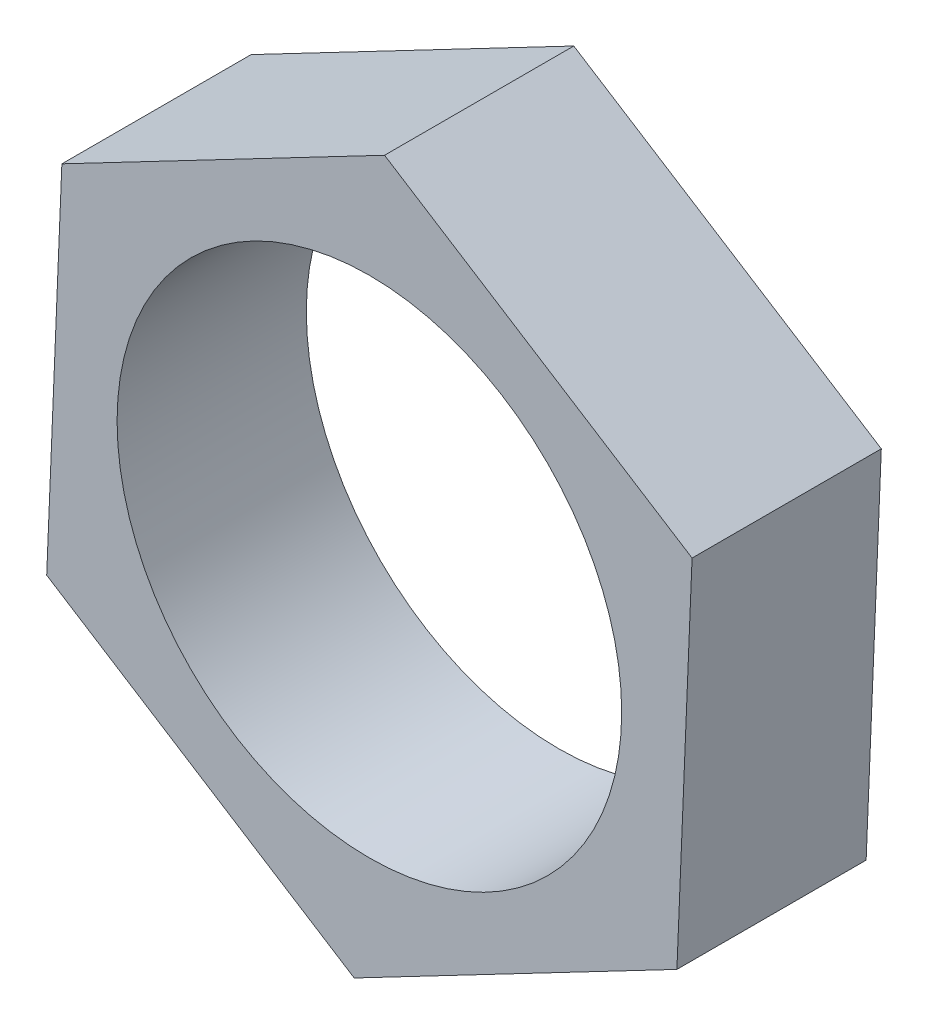
ISO-10303-21;
HEADER;
FILE_DESCRIPTION(('STEP AP214'),'2;1');
FILE_NAME('part.step','',(''),(''),'','','');
FILE_SCHEMA(('AUTOMOTIVE_DESIGN { 1 0 10303 214 1 1 1 1 }'));
ENDSEC;
DATA;
#1=APPLICATION_CONTEXT('core data for automotive mechanical design processes');
#2=APPLICATION_PROTOCOL_DEFINITION('international standard','automotive_design',2000,#1);
#3=PRODUCT_CONTEXT('',#1,'mechanical');
#4=PRODUCT('Part','Part','',(#3));
#5=PRODUCT_RELATED_PRODUCT_CATEGORY('part','',(#4));
#6=PRODUCT_DEFINITION_FORMATION('','',#4);
#7=PRODUCT_DEFINITION_CONTEXT('part definition',#1,'design');
#8=PRODUCT_DEFINITION('design','',#6,#7);
#9=PRODUCT_DEFINITION_SHAPE('','',#8);
#10=(LENGTH_UNIT() NAMED_UNIT(*) SI_UNIT(.MILLI.,.METRE.));
#11=(NAMED_UNIT(*) PLANE_ANGLE_UNIT() SI_UNIT($,.RADIAN.));
#12=(NAMED_UNIT(*) SI_UNIT($,.STERADIAN.) SOLID_ANGLE_UNIT());
#13=UNCERTAINTY_MEASURE_WITH_UNIT(LENGTH_MEASURE(1.E-05),#10,'distance_accuracy_value','');
#14=(GEOMETRIC_REPRESENTATION_CONTEXT(3) GLOBAL_UNCERTAINTY_ASSIGNED_CONTEXT((#13)) GLOBAL_UNIT_ASSIGNED_CONTEXT((#10,
#11,#12)) REPRESENTATION_CONTEXT('',''));
#15=CARTESIAN_POINT('',(0.,0.,0.));
#16=DIRECTION('',(0.,0.,1.));
#17=DIRECTION('',(1.,0.,0.));
#18=AXIS2_PLACEMENT_3D('',#15,#16,#17);
#19=CARTESIAN_POINT('',(-0.240572618673107,-5.76848837638422,-3.));
#20=DIRECTION('',(-0.463479854737405,0.886107456380203,0.));
#21=DIRECTION('',(-0.886107456380203,-0.463479854737405,0.));
#22=AXIS2_PLACEMENT_3D('',#19,#20,#21);
#23=PLANE('',#22);
#24=DIRECTION('',(0.886107456380203,0.463479854737405,0.));
#25=VECTOR('',#24,1.);
#26=CARTESIAN_POINT('',(-0.240572618673107,-5.76848837638422,0.));
#27=LINE('',#26,#25);
#28=CARTESIAN_POINT('',(-0.240572618673107,-5.76848837638422,0.));
#29=VERTEX_POINT('',#28);
#30=CARTESIAN_POINT('',(4.87537116604725,-3.09258618741809,0.));
#31=VERTEX_POINT('',#30);
#32=EDGE_CURVE('E118',#29,#31,#27,.T.);
#33=ORIENTED_EDGE('',*,*,#32,.F.);
#34=DIRECTION('',(0.,0.,0.999999999999999));
#35=VECTOR('',#34,1.);
#36=CARTESIAN_POINT('',(-0.240572618673107,-5.76848837638422,-3.));
#37=LINE('',#36,#35);
#38=CARTESIAN_POINT('',(-0.240572618673107,-5.76848837638422,-3.));
#39=VERTEX_POINT('',#38);
#40=EDGE_CURVE('E117',#39,#29,#37,.T.);
#41=ORIENTED_EDGE('',*,*,#40,.F.);
#42=DIRECTION('',(0.886107456380203,0.463479854737405,0.));
#43=VECTOR('',#42,1.);
#44=CARTESIAN_POINT('',(-0.240572618673107,-5.76848837638422,-3.));
#45=LINE('',#44,#43);
#46=CARTESIAN_POINT('',(4.87537116604725,-3.09258618741809,-3.));
#47=VERTEX_POINT('',#46);
#48=EDGE_CURVE('E131',#39,#47,#45,.T.);
#49=ORIENTED_EDGE('',*,*,#48,.T.);
#50=DIRECTION('',(0.,0.,0.999999999999999));
#51=VECTOR('',#50,1.);
#52=CARTESIAN_POINT('',(4.87537116604725,-3.09258618741809,-3.));
#53=LINE('',#52,#51);
#54=EDGE_CURVE('E11',#47,#31,#53,.T.);
#55=ORIENTED_EDGE('',*,*,#54,.T.);
#56=EDGE_LOOP('',(#33,#41,#49,#55));
#57=FACE_BOUND('',#56,.T.);
#58=ADVANCED_FACE('F35',(#57),#23,.F.);
#59=CARTESIAN_POINT('',(4.87537116604725,-3.09258618741809,-3.));
#60=DIRECTION('',(-0.99913149507677,0.0416683998451878,0.));
#61=DIRECTION('',(-0.0416683998451878,-0.99913149507677,0.));
#62=AXIS2_PLACEMENT_3D('',#59,#60,#61);
#63=PLANE('',#62);
#64=DIRECTION('',(0.0416683998451878,0.99913149507677,0.));
#65=VECTOR('',#64,1.);
#66=CARTESIAN_POINT('',(4.87537116604725,-3.09258618741809,0.));
#67=LINE('',#66,#65);
#68=CARTESIAN_POINT('',(5.11594378472052,2.67590218896602,0.));
#69=VERTEX_POINT('',#68);
#70=EDGE_CURVE('E120',#31,#69,#67,.T.);
#71=ORIENTED_EDGE('',*,*,#70,.F.);
#72=ORIENTED_EDGE('',*,*,#54,.F.);
#73=DIRECTION('',(0.0416683998451878,0.99913149507677,0.));
#74=VECTOR('',#73,1.);
#75=CARTESIAN_POINT('',(4.87537116604725,-3.09258618741809,-3.));
#76=LINE('',#75,#74);
#77=CARTESIAN_POINT('',(5.11594378472052,2.67590218896602,-3.));
#78=VERTEX_POINT('',#77);
#79=EDGE_CURVE('E83',#47,#78,#76,.T.);
#80=ORIENTED_EDGE('',*,*,#79,.T.);
#81=DIRECTION('',(0.,0.,0.999999999999999));
#82=VECTOR('',#81,1.);
#83=CARTESIAN_POINT('',(5.11594378472052,2.67590218896602,-3.));
#84=LINE('',#83,#82);
#85=EDGE_CURVE('E43',#78,#69,#84,.T.);
#86=ORIENTED_EDGE('',*,*,#85,.T.);
#87=EDGE_LOOP('',(#71,#72,#80,#86));
#88=FACE_BOUND('',#87,.T.);
#89=ADVANCED_FACE('F137',(#88),#63,.F.);
#90=CARTESIAN_POINT('',(5.11594378472052,2.67590218896602,-3.));
#91=DIRECTION('',(-0.535651640339365,-0.844439056535016,0.));
#92=DIRECTION('',(0.844439056535016,-0.535651640339365,0.));
#93=AXIS2_PLACEMENT_3D('',#90,#91,#92);
#94=PLANE('',#93);
#95=DIRECTION('',(-0.844439056535016,0.535651640339365,0.));
#96=VECTOR('',#95,1.);
#97=CARTESIAN_POINT('',(5.11594378472052,2.67590218896602,0.));
#98=LINE('',#97,#96);
#99=CARTESIAN_POINT('',(0.240572618673274,5.768488376384,0.));
#100=VERTEX_POINT('',#99);
#101=EDGE_CURVE('E124',#69,#100,#98,.T.);
#102=ORIENTED_EDGE('',*,*,#101,.F.);
#103=ORIENTED_EDGE('',*,*,#85,.F.);
#104=DIRECTION('',(-0.844439056535016,0.535651640339365,0.));
#105=VECTOR('',#104,1.);
#106=CARTESIAN_POINT('',(5.11594378472052,2.67590218896602,-3.));
#107=LINE('',#106,#105);
#108=CARTESIAN_POINT('',(0.240572618673274,5.768488376384,-3.));
#109=VERTEX_POINT('',#108);
#110=EDGE_CURVE('E111',#78,#109,#107,.T.);
#111=ORIENTED_EDGE('',*,*,#110,.T.);
#112=DIRECTION('',(0.,0.,0.999999999999999));
#113=VECTOR('',#112,1.);
#114=CARTESIAN_POINT('',(0.240572618673274,5.768488376384,-3.));
#115=LINE('',#114,#113);
#116=EDGE_CURVE('E105',#109,#100,#115,.T.);
#117=ORIENTED_EDGE('',*,*,#116,.T.);
#118=EDGE_LOOP('',(#102,#103,#111,#117));
#119=FACE_BOUND('',#118,.T.);
#120=ADVANCED_FACE('F170',(#119),#94,.F.);
#121=CARTESIAN_POINT('',(0.240572618673274,5.768488376384,-3.));
#122=DIRECTION('',(0.463479854737405,-0.886107456380203,0.));
#123=DIRECTION('',(0.886107456380203,0.463479854737405,0.));
#124=AXIS2_PLACEMENT_3D('',#121,#122,#123);
#125=PLANE('',#124);
#126=DIRECTION('',(-0.886107456380203,-0.463479854737405,0.));
#127=VECTOR('',#126,1.);
#128=CARTESIAN_POINT('',(0.240572618673274,5.768488376384,0.));
#129=LINE('',#128,#127);
#130=CARTESIAN_POINT('',(-4.87537116604723,3.09258618741798,0.));
#131=VERTEX_POINT('',#130);
#132=EDGE_CURVE('E127',#100,#131,#129,.T.);
#133=ORIENTED_EDGE('',*,*,#132,.F.);
#134=ORIENTED_EDGE('',*,*,#116,.F.);
#135=DIRECTION('',(-0.886107456380203,-0.463479854737405,0.));
#136=VECTOR('',#135,1.);
#137=CARTESIAN_POINT('',(0.240572618673274,5.768488376384,-3.));
#138=LINE('',#137,#136);
#139=CARTESIAN_POINT('',(-4.87537116604723,3.09258618741798,-3.));
#140=VERTEX_POINT('',#139);
#141=EDGE_CURVE('E95',#109,#140,#138,.T.);
#142=ORIENTED_EDGE('',*,*,#141,.T.);
#143=DIRECTION('',(0.,0.,0.999999999999999));
#144=VECTOR('',#143,1.);
#145=CARTESIAN_POINT('',(-4.87537116604723,3.09258618741798,-3.));
#146=LINE('',#145,#144);
#147=EDGE_CURVE('E100',#140,#131,#146,.T.);
#148=ORIENTED_EDGE('',*,*,#147,.T.);
#149=EDGE_LOOP('',(#133,#134,#142,#148));
#150=FACE_BOUND('',#149,.T.);
#151=ADVANCED_FACE('F108',(#150),#125,.F.);
#152=CARTESIAN_POINT('',(-4.87537116604723,3.09258618741798,-3.));
#153=DIRECTION('',(0.99913149507677,-0.0416683998451877,0.));
#154=DIRECTION('',(0.0416683998451877,0.99913149507677,0.));
#155=AXIS2_PLACEMENT_3D('',#152,#153,#154);
#156=PLANE('',#155);
#157=DIRECTION('',(-0.0416683998451878,-0.99913149507677,0.));
#158=VECTOR('',#157,1.);
#159=CARTESIAN_POINT('',(-4.87537116604723,3.09258618741798,0.));
#160=LINE('',#159,#158);
#161=CARTESIAN_POINT('',(-5.11594378472041,-2.67590218896618,0.));
#162=VERTEX_POINT('',#161);
#163=EDGE_CURVE('E102',#131,#162,#160,.T.);
#164=ORIENTED_EDGE('',*,*,#163,.F.);
#165=ORIENTED_EDGE('',*,*,#147,.F.);
#166=DIRECTION('',(-0.0416683998451878,-0.99913149507677,0.));
#167=VECTOR('',#166,1.);
#168=CARTESIAN_POINT('',(-4.87537116604723,3.09258618741798,-3.));
#169=LINE('',#168,#167);
#170=CARTESIAN_POINT('',(-5.11594378472041,-2.67590218896618,-3.));
#171=VERTEX_POINT('',#170);
#172=EDGE_CURVE('E91',#140,#171,#169,.T.);
#173=ORIENTED_EDGE('',*,*,#172,.T.);
#174=DIRECTION('',(0.,0.,0.999999999999999));
#175=VECTOR('',#174,1.);
#176=CARTESIAN_POINT('',(-5.11594378472041,-2.67590218896618,-3.));
#177=LINE('',#176,#175);
#178=EDGE_CURVE('E106',#171,#162,#177,.T.);
#179=ORIENTED_EDGE('',*,*,#178,.T.);
#180=EDGE_LOOP('',(#164,#165,#173,#179));
#181=FACE_BOUND('',#180,.T.);
#182=ADVANCED_FACE('F101',(#181),#156,.F.);
#183=CARTESIAN_POINT('',(-5.11594378472041,-2.67590218896618,-3.));
#184=DIRECTION('',(0.535651640339365,0.844439056535015,0.));
#185=DIRECTION('',(-0.844439056535016,0.535651640339365,0.));
#186=AXIS2_PLACEMENT_3D('',#183,#184,#185);
#187=PLANE('',#186);
#188=DIRECTION('',(0.844439056535015,-0.535651640339365,0.));
#189=VECTOR('',#188,1.);
#190=CARTESIAN_POINT('',(-5.11594378472041,-2.67590218896618,0.));
#191=LINE('',#190,#189);
#192=EDGE_CURVE('E71',#162,#29,#191,.T.);
#193=ORIENTED_EDGE('',*,*,#192,.F.);
#194=ORIENTED_EDGE('',*,*,#178,.F.);
#195=DIRECTION('',(0.844439056535015,-0.535651640339365,0.));
#196=VECTOR('',#195,1.);
#197=CARTESIAN_POINT('',(-5.11594378472041,-2.67590218896618,-3.));
#198=LINE('',#197,#196);
#199=EDGE_CURVE('E51',#171,#39,#198,.T.);
#200=ORIENTED_EDGE('',*,*,#199,.T.);
#201=ORIENTED_EDGE('',*,*,#40,.T.);
#202=EDGE_LOOP('',(#193,#194,#200,#201));
#203=FACE_BOUND('',#202,.T.);
#204=ADVANCED_FACE('F162',(#203),#187,.F.);
#205=CARTESIAN_POINT('',(0.,0.,-3.));
#206=DIRECTION('',(0.,0.,-0.999999999999999));
#207=DIRECTION('',(1.,0.,0.));
#208=AXIS2_PLACEMENT_3D('',#205,#206,#207);
#209=PLANE('',#208);
#210=CARTESIAN_POINT('',(0.,0.,-3.));
#211=DIRECTION('',(0.,0.,0.999999999999999));
#212=DIRECTION('',(1.,0.,0.));
#213=AXIS2_PLACEMENT_3D('',#210,#211,#212);
#214=CIRCLE('',#213,4.);
#215=CARTESIAN_POINT('',(4.,0.,-3.));
#216=VERTEX_POINT('',#215);
#217=EDGE_CURVE('E146',#216,#216,#214,.T.);
#218=ORIENTED_EDGE('',*,*,#217,.T.);
#219=EDGE_LOOP('',(#218));
#220=FACE_BOUND('',#219,.T.);
#221=ORIENTED_EDGE('',*,*,#48,.F.);
#222=ORIENTED_EDGE('',*,*,#199,.F.);
#223=ORIENTED_EDGE('',*,*,#172,.F.);
#224=ORIENTED_EDGE('',*,*,#141,.F.);
#225=ORIENTED_EDGE('',*,*,#110,.F.);
#226=ORIENTED_EDGE('',*,*,#79,.F.);
#227=EDGE_LOOP('',(#221,#222,#223,#224,#225,#226));
#228=FACE_BOUND('',#227,.T.);
#229=ADVANCED_FACE('F93',(#220,#228),#209,.T.);
#230=CARTESIAN_POINT('',(0.,0.,0.));
#231=DIRECTION('',(0.,0.,-0.999999999999999));
#232=DIRECTION('',(1.,0.,0.));
#233=AXIS2_PLACEMENT_3D('',#230,#231,#232);
#234=PLANE('',#233);
#235=CARTESIAN_POINT('',(0.,0.,0.));
#236=DIRECTION('',(0.,0.,0.999999999999999));
#237=DIRECTION('',(1.,0.,0.));
#238=AXIS2_PLACEMENT_3D('',#235,#236,#237);
#239=CIRCLE('',#238,4.);
#240=CARTESIAN_POINT('',(4.,0.,0.));
#241=VERTEX_POINT('',#240);
#242=EDGE_CURVE('E121',#241,#241,#239,.T.);
#243=ORIENTED_EDGE('',*,*,#242,.F.);
#244=EDGE_LOOP('',(#243));
#245=FACE_BOUND('',#244,.T.);
#246=ORIENTED_EDGE('',*,*,#32,.T.);
#247=ORIENTED_EDGE('',*,*,#70,.T.);
#248=ORIENTED_EDGE('',*,*,#101,.T.);
#249=ORIENTED_EDGE('',*,*,#132,.T.);
#250=ORIENTED_EDGE('',*,*,#163,.T.);
#251=ORIENTED_EDGE('',*,*,#192,.T.);
#252=EDGE_LOOP('',(#246,#247,#248,#249,#250,#251));
#253=FACE_BOUND('',#252,.T.);
#254=ADVANCED_FACE('F139',(#245,#253),#234,.F.);
#255=CARTESIAN_POINT('',(0.,0.,0.));
#256=DIRECTION('',(0.,0.,-0.999999999999999));
#257=DIRECTION('',(1.,0.,0.));
#258=AXIS2_PLACEMENT_3D('',#255,#256,#257);
#259=CYLINDRICAL_SURFACE('',#258,4.);
#260=CARTESIAN_POINT('',(4.,0.,0.));
#261=CARTESIAN_POINT('',(4.,0.,-0.03125));
#262=CARTESIAN_POINT('',(4.,0.,-0.0625000000000001));
#263=CARTESIAN_POINT('',(4.,0.,-0.125));
#264=CARTESIAN_POINT('',(4.,0.,-0.15625));
#265=CARTESIAN_POINT('',(4.,0.,-0.21875));
#266=CARTESIAN_POINT('',(4.,0.,-0.25));
#267=CARTESIAN_POINT('',(4.,0.,-0.3125));
#268=CARTESIAN_POINT('',(4.,0.,-0.34375));
#269=CARTESIAN_POINT('',(4.,0.,-0.40625));
#270=CARTESIAN_POINT('',(4.,0.,-0.4375));
#271=CARTESIAN_POINT('',(4.,0.,-0.5));
#272=CARTESIAN_POINT('',(4.,0.,-0.53125));
#273=CARTESIAN_POINT('',(4.,0.,-0.59375));
#274=CARTESIAN_POINT('',(4.,0.,-0.625000000000001));
#275=CARTESIAN_POINT('',(4.,0.,-0.687500000000001));
#276=CARTESIAN_POINT('',(4.,0.,-0.718750000000001));
#277=CARTESIAN_POINT('',(4.,0.,-0.781250000000001));
#278=CARTESIAN_POINT('',(4.,0.,-0.812500000000001));
#279=CARTESIAN_POINT('',(4.,0.,-0.875000000000001));
#280=CARTESIAN_POINT('',(4.,0.,-0.906250000000001));
#281=CARTESIAN_POINT('',(4.,0.,-0.968750000000001));
#282=CARTESIAN_POINT('',(4.,0.,-1.));
#283=CARTESIAN_POINT('',(4.,0.,-1.0625));
#284=CARTESIAN_POINT('',(4.,0.,-1.09375));
#285=CARTESIAN_POINT('',(4.,0.,-1.15625));
#286=CARTESIAN_POINT('',(4.,0.,-1.1875));
#287=CARTESIAN_POINT('',(4.,0.,-1.25));
#288=CARTESIAN_POINT('',(4.,0.,-1.28125));
#289=CARTESIAN_POINT('',(4.,0.,-1.34375));
#290=CARTESIAN_POINT('',(4.,0.,-1.375));
#291=CARTESIAN_POINT('',(4.,0.,-1.4375));
#292=CARTESIAN_POINT('',(4.,0.,-1.46875));
#293=CARTESIAN_POINT('',(4.,0.,-1.53125));
#294=CARTESIAN_POINT('',(4.,0.,-1.5625));
#295=CARTESIAN_POINT('',(4.,0.,-1.625));
#296=CARTESIAN_POINT('',(4.,0.,-1.65625));
#297=CARTESIAN_POINT('',(4.,0.,-1.71875));
#298=CARTESIAN_POINT('',(4.,0.,-1.75));
#299=CARTESIAN_POINT('',(4.,0.,-1.8125));
#300=CARTESIAN_POINT('',(4.,0.,-1.84375));
#301=CARTESIAN_POINT('',(4.,0.,-1.90625));
#302=CARTESIAN_POINT('',(4.,0.,-1.9375));
#303=CARTESIAN_POINT('',(4.,0.,-2.));
#304=CARTESIAN_POINT('',(4.,0.,-2.03125));
#305=CARTESIAN_POINT('',(4.,0.,-2.09375));
#306=CARTESIAN_POINT('',(4.,0.,-2.125));
#307=CARTESIAN_POINT('',(4.,0.,-2.1875));
#308=CARTESIAN_POINT('',(4.,0.,-2.21875));
#309=CARTESIAN_POINT('',(4.,0.,-2.28125));
#310=CARTESIAN_POINT('',(4.,0.,-2.3125));
#311=CARTESIAN_POINT('',(4.,0.,-2.375));
#312=CARTESIAN_POINT('',(4.,0.,-2.40625));
#313=CARTESIAN_POINT('',(4.,0.,-2.46875));
#314=CARTESIAN_POINT('',(4.,0.,-2.5));
#315=CARTESIAN_POINT('',(4.,0.,-2.5625));
#316=CARTESIAN_POINT('',(4.,0.,-2.59375));
#317=CARTESIAN_POINT('',(4.,0.,-2.65625));
#318=CARTESIAN_POINT('',(4.,0.,-2.6875));
#319=CARTESIAN_POINT('',(4.,0.,-2.75));
#320=CARTESIAN_POINT('',(4.,0.,-2.78125));
#321=CARTESIAN_POINT('',(4.,0.,-2.84375));
#322=CARTESIAN_POINT('',(4.,0.,-2.875));
#323=CARTESIAN_POINT('',(4.,0.,-2.9375));
#324=CARTESIAN_POINT('',(4.,0.,-2.96875));
#325=CARTESIAN_POINT('',(4.,0.,-3.));
#326=B_SPLINE_CURVE_WITH_KNOTS('',3,(#260,#261,#262,#263,#264,#265,#266,#267,#268,#269,#270,
#271,#272,#273,#274,#275,#276,#277,#278,#279,#280,#281,#282,#283,#284,#285,#286,#287,#288,#289,
#290,#291,#292,#293,#294,#295,#296,#297,#298,#299,#300,#301,#302,#303,#304,#305,#306,#307,#308,
#309,#310,#311,#312,#313,#314,#315,#316,#317,#318,#319,#320,#321,#322,#323,#324,#325),
.UNSPECIFIED.,.F.,.F.,(4,2,2,2,2,2,2,2,2,2,2,2,2,2,2,2,2,2,2,2,2,2,2,2,2,2,2,2,2,2,2,2,4),(0.,
0.0937500000000001,0.1875,0.28125,0.375,0.46875,0.5625,0.656250000000001,0.750000000000001,
0.843750000000001,0.937500000000001,1.03125,1.125,1.21875,1.3125,1.40625,1.5,1.59375,1.6875,
1.78125,1.875,1.96875,2.0625,2.15625,2.25,2.34375,2.4375,2.53125,2.625,2.71875,2.8125,2.90625,
3.),.UNSPECIFIED.);
#327=EDGE_CURVE('BSEAM152',#241,#216,#326,.T.);
#328=ORIENTED_EDGE('',*,*,#242,.T.);
#329=ORIENTED_EDGE('',*,*,#217,.F.);
#330=ORIENTED_EDGE('',*,*,#327,.T.);
#331=ORIENTED_EDGE('',*,*,#327,.F.);
#332=EDGE_LOOP('',(#328,#330,#329,#331));
#333=FACE_BOUND('',#332,.T.);
#334=ADVANCED_FACE('F152',(#333),#259,.F.);
#335=CLOSED_SHELL('',(#58,#89,#120,#151,#182,#204,#229,#254,#334));
#336=MANIFOLD_SOLID_BREP('B2',#335);
#337=ADVANCED_BREP_SHAPE_REPRESENTATION('',(#18,#336),#14);
#338=SHAPE_DEFINITION_REPRESENTATION(#9,#337);
ENDSEC;
END-ISO-10303-21;
